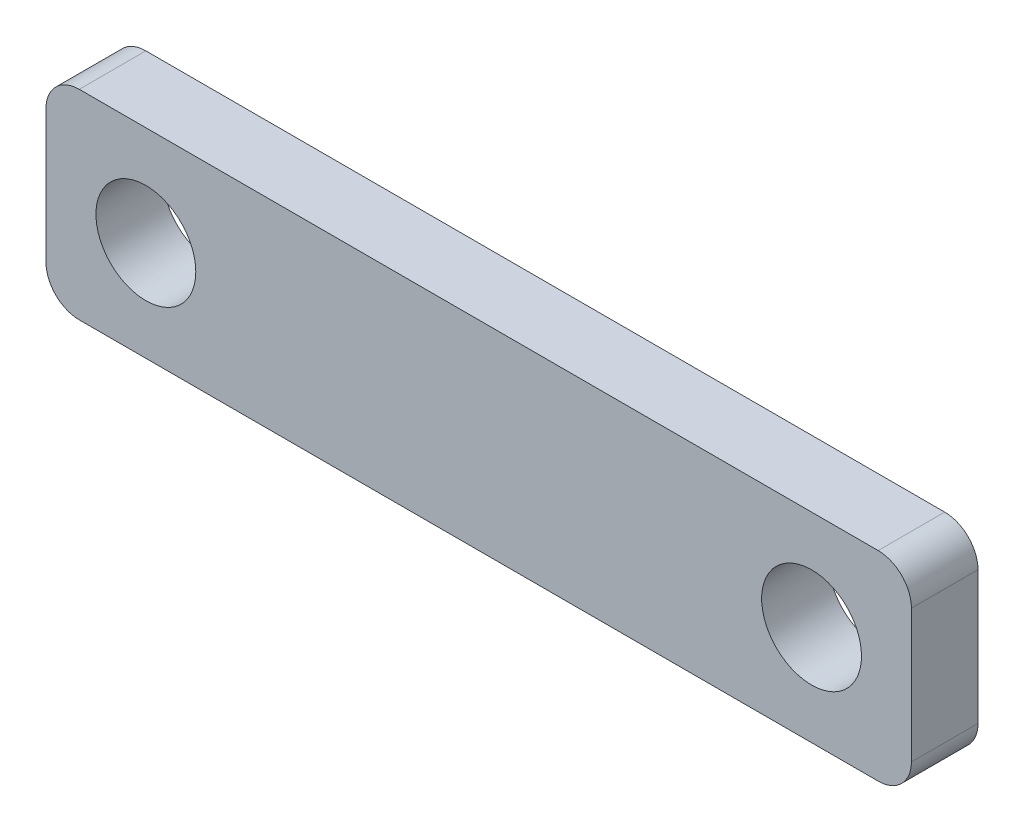
ISO-10303-21;
HEADER;
FILE_DESCRIPTION(('STEP AP214'),'2;1');
FILE_NAME('part.step','',(''),(''),'','','');
FILE_SCHEMA(('AUTOMOTIVE_DESIGN { 1 0 10303 214 1 1 1 1 }'));
ENDSEC;
DATA;
#1=APPLICATION_CONTEXT('core data for automotive mechanical design processes');
#2=APPLICATION_PROTOCOL_DEFINITION('international standard','automotive_design',2000,#1);
#3=PRODUCT_CONTEXT('',#1,'mechanical');
#4=PRODUCT('Part','Part','',(#3));
#5=PRODUCT_RELATED_PRODUCT_CATEGORY('part','',(#4));
#6=PRODUCT_DEFINITION_FORMATION('','',#4);
#7=PRODUCT_DEFINITION_CONTEXT('part definition',#1,'design');
#8=PRODUCT_DEFINITION('design','',#6,#7);
#9=PRODUCT_DEFINITION_SHAPE('','',#8);
#10=(LENGTH_UNIT() NAMED_UNIT(*) SI_UNIT(.MILLI.,.METRE.));
#11=(NAMED_UNIT(*) PLANE_ANGLE_UNIT() SI_UNIT($,.RADIAN.));
#12=(NAMED_UNIT(*) SI_UNIT($,.STERADIAN.) SOLID_ANGLE_UNIT());
#13=UNCERTAINTY_MEASURE_WITH_UNIT(LENGTH_MEASURE(1.E-05),#10,'distance_accuracy_value','');
#14=(GEOMETRIC_REPRESENTATION_CONTEXT(3) GLOBAL_UNCERTAINTY_ASSIGNED_CONTEXT((#13)) GLOBAL_UNIT_ASSIGNED_CONTEXT((#10,
#11,#12)) REPRESENTATION_CONTEXT('',''));
#15=CARTESIAN_POINT('',(0.,0.,0.));
#16=DIRECTION('',(0.,0.,1.));
#17=DIRECTION('',(1.,0.,0.));
#18=AXIS2_PLACEMENT_3D('',#15,#16,#17);
#19=CARTESIAN_POINT('',(0.,0.,2.));
#20=DIRECTION('',(0.,0.,-1.));
#21=DIRECTION('',(-1.,0.,0.));
#22=AXIS2_PLACEMENT_3D('',#19,#20,#21);
#23=PLANE('',#22);
#24=DIRECTION('',(0.,-1.,0.));
#25=VECTOR('',#24,1.);
#26=CARTESIAN_POINT('',(-13.,-3.,2.));
#27=LINE('',#26,#25);
#28=CARTESIAN_POINT('',(-13.,2.,2.));
#29=VERTEX_POINT('',#28);
#30=CARTESIAN_POINT('',(-13.,-2.,2.));
#31=VERTEX_POINT('',#30);
#32=EDGE_CURVE('E175',#29,#31,#27,.T.);
#33=ORIENTED_EDGE('',*,*,#32,.T.);
#34=CARTESIAN_POINT('',(-12.,-2.,2.));
#35=DIRECTION('',(0.,0.,-1.));
#36=DIRECTION('',(-1.,0.,0.));
#37=AXIS2_PLACEMENT_3D('',#34,#35,#36);
#38=CIRCLE('',#37,1.);
#39=CARTESIAN_POINT('',(-12.,-3.,2.));
#40=VERTEX_POINT('',#39);
#41=EDGE_CURVE('E152',#31,#40,#38,.F.);
#42=ORIENTED_EDGE('',*,*,#41,.T.);
#43=DIRECTION('',(1.,0.,0.));
#44=VECTOR('',#43,1.);
#45=CARTESIAN_POINT('',(-13.,-3.,2.));
#46=LINE('',#45,#44);
#47=CARTESIAN_POINT('',(12.,-3.,2.));
#48=VERTEX_POINT('',#47);
#49=EDGE_CURVE('E123',#40,#48,#46,.T.);
#50=ORIENTED_EDGE('',*,*,#49,.T.);
#51=CARTESIAN_POINT('',(12.,-2.,2.));
#52=DIRECTION('',(0.,0.,-1.));
#53=DIRECTION('',(-1.,0.,0.));
#54=AXIS2_PLACEMENT_3D('',#51,#52,#53);
#55=CIRCLE('',#54,1.);
#56=CARTESIAN_POINT('',(13.,-2.,2.));
#57=VERTEX_POINT('',#56);
#58=EDGE_CURVE('E150',#48,#57,#55,.F.);
#59=ORIENTED_EDGE('',*,*,#58,.T.);
#60=DIRECTION('',(0.,1.,0.));
#61=VECTOR('',#60,1.);
#62=CARTESIAN_POINT('',(13.,-3.,2.));
#63=LINE('',#62,#61);
#64=CARTESIAN_POINT('',(13.,2.,2.));
#65=VERTEX_POINT('',#64);
#66=EDGE_CURVE('E130',#57,#65,#63,.T.);
#67=ORIENTED_EDGE('',*,*,#66,.T.);
#68=CARTESIAN_POINT('',(12.,2.,2.));
#69=DIRECTION('',(0.,0.,-1.));
#70=DIRECTION('',(-1.,0.,0.));
#71=AXIS2_PLACEMENT_3D('',#68,#69,#70);
#72=CIRCLE('',#71,1.);
#73=CARTESIAN_POINT('',(12.,3.,2.));
#74=VERTEX_POINT('',#73);
#75=EDGE_CURVE('E58',#65,#74,#72,.F.);
#76=ORIENTED_EDGE('',*,*,#75,.T.);
#77=DIRECTION('',(-1.,0.,0.));
#78=VECTOR('',#77,1.);
#79=CARTESIAN_POINT('',(-13.,3.,2.));
#80=LINE('',#79,#78);
#81=CARTESIAN_POINT('',(-12.,3.,2.));
#82=VERTEX_POINT('',#81);
#83=EDGE_CURVE('E133',#74,#82,#80,.T.);
#84=ORIENTED_EDGE('',*,*,#83,.T.);
#85=CARTESIAN_POINT('',(-12.,2.,2.));
#86=DIRECTION('',(0.,0.,-1.));
#87=DIRECTION('',(-1.,0.,0.));
#88=AXIS2_PLACEMENT_3D('',#85,#86,#87);
#89=CIRCLE('',#88,1.);
#90=EDGE_CURVE('E147',#82,#29,#89,.F.);
#91=ORIENTED_EDGE('',*,*,#90,.T.);
#92=EDGE_LOOP('',(#33,#42,#50,#59,#67,#76,#84,#91));
#93=FACE_BOUND('',#92,.T.);
#94=CARTESIAN_POINT('',(10.,0.,2.));
#95=DIRECTION('',(0.,0.,1.));
#96=DIRECTION('',(1.,0.,0.));
#97=AXIS2_PLACEMENT_3D('',#94,#95,#96);
#98=CIRCLE('',#97,1.5);
#99=CARTESIAN_POINT('',(11.5,0.,2.));
#100=VERTEX_POINT('',#99);
#101=EDGE_CURVE('E168',#100,#100,#98,.T.);
#102=ORIENTED_EDGE('',*,*,#101,.F.);
#103=EDGE_LOOP('',(#102));
#104=FACE_BOUND('',#103,.T.);
#105=CARTESIAN_POINT('',(-10.,0.,2.));
#106=DIRECTION('',(0.,0.,1.));
#107=DIRECTION('',(1.,0.,0.));
#108=AXIS2_PLACEMENT_3D('',#105,#106,#107);
#109=CIRCLE('',#108,1.5);
#110=CARTESIAN_POINT('',(-8.5,0.,2.));
#111=VERTEX_POINT('',#110);
#112=EDGE_CURVE('E180',#111,#111,#109,.T.);
#113=ORIENTED_EDGE('',*,*,#112,.F.);
#114=EDGE_LOOP('',(#113));
#115=FACE_BOUND('',#114,.T.);
#116=ADVANCED_FACE('F37',(#93,#104,#115),#23,.F.);
#117=CARTESIAN_POINT('',(0.,0.,0.));
#118=DIRECTION('',(0.,0.,-1.));
#119=DIRECTION('',(-1.,0.,0.));
#120=AXIS2_PLACEMENT_3D('',#117,#118,#119);
#121=PLANE('',#120);
#122=CARTESIAN_POINT('',(10.,0.,0.));
#123=DIRECTION('',(0.,0.,1.));
#124=DIRECTION('',(1.,0.,0.));
#125=AXIS2_PLACEMENT_3D('',#122,#123,#124);
#126=CIRCLE('',#125,1.5);
#127=CARTESIAN_POINT('',(11.5,0.,0.));
#128=VERTEX_POINT('',#127);
#129=EDGE_CURVE('E171',#128,#128,#126,.T.);
#130=ORIENTED_EDGE('',*,*,#129,.T.);
#131=EDGE_LOOP('',(#130));
#132=FACE_BOUND('',#131,.T.);
#133=DIRECTION('',(1.,0.,0.));
#134=VECTOR('',#133,1.);
#135=CARTESIAN_POINT('',(-13.,-3.,0.));
#136=LINE('',#135,#134);
#137=CARTESIAN_POINT('',(-12.,-3.,0.));
#138=VERTEX_POINT('',#137);
#139=CARTESIAN_POINT('',(12.,-3.,0.));
#140=VERTEX_POINT('',#139);
#141=EDGE_CURVE('E120',#138,#140,#136,.T.);
#142=ORIENTED_EDGE('',*,*,#141,.F.);
#143=CARTESIAN_POINT('',(-12.,-2.,0.));
#144=DIRECTION('',(0.,0.,-1.));
#145=DIRECTION('',(-1.,0.,0.));
#146=AXIS2_PLACEMENT_3D('',#143,#144,#145);
#147=CIRCLE('',#146,1.);
#148=CARTESIAN_POINT('',(-13.,-2.,0.));
#149=VERTEX_POINT('',#148);
#150=EDGE_CURVE('E103',#138,#149,#147,.T.);
#151=ORIENTED_EDGE('',*,*,#150,.T.);
#152=DIRECTION('',(0.,-1.,0.));
#153=VECTOR('',#152,1.);
#154=CARTESIAN_POINT('',(-13.,-3.,0.));
#155=LINE('',#154,#153);
#156=CARTESIAN_POINT('',(-13.,2.,0.));
#157=VERTEX_POINT('',#156);
#158=EDGE_CURVE('E131',#157,#149,#155,.T.);
#159=ORIENTED_EDGE('',*,*,#158,.F.);
#160=CARTESIAN_POINT('',(-12.,2.,0.));
#161=DIRECTION('',(0.,0.,-1.));
#162=DIRECTION('',(-1.,0.,0.));
#163=AXIS2_PLACEMENT_3D('',#160,#161,#162);
#164=CIRCLE('',#163,1.);
#165=CARTESIAN_POINT('',(-12.,3.,0.));
#166=VERTEX_POINT('',#165);
#167=EDGE_CURVE('E124',#157,#166,#164,.T.);
#168=ORIENTED_EDGE('',*,*,#167,.T.);
#169=DIRECTION('',(-1.,0.,0.));
#170=VECTOR('',#169,1.);
#171=CARTESIAN_POINT('',(-13.,3.,0.));
#172=LINE('',#171,#170);
#173=CARTESIAN_POINT('',(12.,3.,0.));
#174=VERTEX_POINT('',#173);
#175=EDGE_CURVE('E135',#174,#166,#172,.T.);
#176=ORIENTED_EDGE('',*,*,#175,.F.);
#177=CARTESIAN_POINT('',(12.,2.,0.));
#178=DIRECTION('',(0.,0.,-1.));
#179=DIRECTION('',(-1.,0.,0.));
#180=AXIS2_PLACEMENT_3D('',#177,#178,#179);
#181=CIRCLE('',#180,1.);
#182=CARTESIAN_POINT('',(13.,2.,0.));
#183=VERTEX_POINT('',#182);
#184=EDGE_CURVE('E141',#174,#183,#181,.T.);
#185=ORIENTED_EDGE('',*,*,#184,.T.);
#186=DIRECTION('',(0.,1.,0.));
#187=VECTOR('',#186,1.);
#188=CARTESIAN_POINT('',(13.,-3.,0.));
#189=LINE('',#188,#187);
#190=CARTESIAN_POINT('',(13.,-2.,0.));
#191=VERTEX_POINT('',#190);
#192=EDGE_CURVE('E163',#191,#183,#189,.T.);
#193=ORIENTED_EDGE('',*,*,#192,.F.);
#194=CARTESIAN_POINT('',(12.,-2.,0.));
#195=DIRECTION('',(0.,0.,-1.));
#196=DIRECTION('',(-1.,0.,0.));
#197=AXIS2_PLACEMENT_3D('',#194,#195,#196);
#198=CIRCLE('',#197,1.);
#199=EDGE_CURVE('E114',#191,#140,#198,.T.);
#200=ORIENTED_EDGE('',*,*,#199,.T.);
#201=EDGE_LOOP('',(#142,#151,#159,#168,#176,#185,#193,#200));
#202=FACE_BOUND('',#201,.T.);
#203=CARTESIAN_POINT('',(-10.,0.,0.));
#204=DIRECTION('',(0.,0.,1.));
#205=DIRECTION('',(1.,0.,0.));
#206=AXIS2_PLACEMENT_3D('',#203,#204,#205);
#207=CIRCLE('',#206,1.5);
#208=CARTESIAN_POINT('',(-8.5,0.,0.));
#209=VERTEX_POINT('',#208);
#210=EDGE_CURVE('E182',#209,#209,#207,.T.);
#211=ORIENTED_EDGE('',*,*,#210,.T.);
#212=EDGE_LOOP('',(#211));
#213=FACE_BOUND('',#212,.T.);
#214=ADVANCED_FACE('F127',(#132,#202,#213),#121,.T.);
#215=CARTESIAN_POINT('',(13.,-3.,2.));
#216=DIRECTION('',(-1.,0.,0.));
#217=DIRECTION('',(0.,0.,1.));
#218=AXIS2_PLACEMENT_3D('',#215,#216,#217);
#219=PLANE('',#218);
#220=ORIENTED_EDGE('',*,*,#66,.F.);
#221=DIRECTION('',(0.,0.,-1.));
#222=VECTOR('',#221,1.);
#223=CARTESIAN_POINT('',(13.,-2.,2.));
#224=LINE('',#223,#222);
#225=EDGE_CURVE('E156',#57,#191,#224,.T.);
#226=ORIENTED_EDGE('',*,*,#225,.T.);
#227=ORIENTED_EDGE('',*,*,#192,.T.);
#228=DIRECTION('',(0.,0.,-1.));
#229=VECTOR('',#228,1.);
#230=CARTESIAN_POINT('',(13.,2.,2.));
#231=LINE('',#230,#229);
#232=EDGE_CURVE('E154',#183,#65,#231,.F.);
#233=ORIENTED_EDGE('',*,*,#232,.T.);
#234=EDGE_LOOP('',(#220,#226,#227,#233));
#235=FACE_BOUND('',#234,.T.);
#236=ADVANCED_FACE('F162',(#235),#219,.F.);
#237=CARTESIAN_POINT('',(-13.,3.,2.));
#238=DIRECTION('',(0.,-1.,0.));
#239=DIRECTION('',(0.,0.,-1.));
#240=AXIS2_PLACEMENT_3D('',#237,#238,#239);
#241=PLANE('',#240);
#242=ORIENTED_EDGE('',*,*,#83,.F.);
#243=DIRECTION('',(0.,0.,-1.));
#244=VECTOR('',#243,1.);
#245=CARTESIAN_POINT('',(12.,3.,2.));
#246=LINE('',#245,#244);
#247=EDGE_CURVE('E11',#74,#174,#246,.T.);
#248=ORIENTED_EDGE('',*,*,#247,.T.);
#249=ORIENTED_EDGE('',*,*,#175,.T.);
#250=DIRECTION('',(0.,0.,-1.));
#251=VECTOR('',#250,1.);
#252=CARTESIAN_POINT('',(-12.,3.,2.));
#253=LINE('',#252,#251);
#254=EDGE_CURVE('E45',#166,#82,#253,.F.);
#255=ORIENTED_EDGE('',*,*,#254,.T.);
#256=EDGE_LOOP('',(#242,#248,#249,#255));
#257=FACE_BOUND('',#256,.T.);
#258=ADVANCED_FACE('F208',(#257),#241,.F.);
#259=CARTESIAN_POINT('',(-13.,-3.,2.));
#260=DIRECTION('',(1.,0.,0.));
#261=DIRECTION('',(0.,0.,-1.));
#262=AXIS2_PLACEMENT_3D('',#259,#260,#261);
#263=PLANE('',#262);
#264=ORIENTED_EDGE('',*,*,#158,.T.);
#265=DIRECTION('',(0.,0.,-1.));
#266=VECTOR('',#265,1.);
#267=CARTESIAN_POINT('',(-13.,-2.,2.));
#268=LINE('',#267,#266);
#269=EDGE_CURVE('E108',#149,#31,#268,.F.);
#270=ORIENTED_EDGE('',*,*,#269,.T.);
#271=ORIENTED_EDGE('',*,*,#32,.F.);
#272=DIRECTION('',(0.,0.,-1.));
#273=VECTOR('',#272,1.);
#274=CARTESIAN_POINT('',(-13.,2.,2.));
#275=LINE('',#274,#273);
#276=EDGE_CURVE('E113',#29,#157,#275,.T.);
#277=ORIENTED_EDGE('',*,*,#276,.T.);
#278=EDGE_LOOP('',(#264,#270,#271,#277));
#279=FACE_BOUND('',#278,.T.);
#280=ADVANCED_FACE('F205',(#279),#263,.F.);
#281=CARTESIAN_POINT('',(-13.,-3.,2.));
#282=DIRECTION('',(0.,1.,0.));
#283=DIRECTION('',(0.,0.,1.));
#284=AXIS2_PLACEMENT_3D('',#281,#282,#283);
#285=PLANE('',#284);
#286=ORIENTED_EDGE('',*,*,#49,.F.);
#287=DIRECTION('',(0.,0.,-1.));
#288=VECTOR('',#287,1.);
#289=CARTESIAN_POINT('',(-12.,-3.,2.));
#290=LINE('',#289,#288);
#291=EDGE_CURVE('E107',#40,#138,#290,.T.);
#292=ORIENTED_EDGE('',*,*,#291,.T.);
#293=ORIENTED_EDGE('',*,*,#141,.T.);
#294=DIRECTION('',(0.,0.,-1.));
#295=VECTOR('',#294,1.);
#296=CARTESIAN_POINT('',(12.,-3.,2.));
#297=LINE('',#296,#295);
#298=EDGE_CURVE('E125',#140,#48,#297,.F.);
#299=ORIENTED_EDGE('',*,*,#298,.T.);
#300=EDGE_LOOP('',(#286,#292,#293,#299));
#301=FACE_BOUND('',#300,.T.);
#302=ADVANCED_FACE('F119',(#301),#285,.F.);
#303=CARTESIAN_POINT('',(10.,0.,2.));
#304=DIRECTION('',(0.,0.,-1.));
#305=DIRECTION('',(-1.,0.,0.));
#306=AXIS2_PLACEMENT_3D('',#303,#304,#305);
#307=CYLINDRICAL_SURFACE('',#306,1.5);
#308=ORIENTED_EDGE('',*,*,#101,.T.);
#309=EDGE_LOOP('',(#308));
#310=FACE_BOUND('',#309,.T.);
#311=ORIENTED_EDGE('',*,*,#129,.F.);
#312=EDGE_LOOP('',(#311));
#313=FACE_BOUND('',#312,.T.);
#314=ADVANCED_FACE('F200',(#310,#313),#307,.F.);
#315=CARTESIAN_POINT('',(-10.,0.,2.));
#316=DIRECTION('',(0.,0.,-1.));
#317=DIRECTION('',(-1.,0.,0.));
#318=AXIS2_PLACEMENT_3D('',#315,#316,#317);
#319=CYLINDRICAL_SURFACE('',#318,1.5);
#320=ORIENTED_EDGE('',*,*,#112,.T.);
#321=EDGE_LOOP('',(#320));
#322=FACE_BOUND('',#321,.T.);
#323=ORIENTED_EDGE('',*,*,#210,.F.);
#324=EDGE_LOOP('',(#323));
#325=FACE_BOUND('',#324,.T.);
#326=ADVANCED_FACE('F188',(#322,#325),#319,.F.);
#327=CARTESIAN_POINT('',(-12.,-2.,2.));
#328=DIRECTION('',(0.,0.,-1.));
#329=DIRECTION('',(-1.,0.,0.));
#330=AXIS2_PLACEMENT_3D('',#327,#328,#329);
#331=CYLINDRICAL_SURFACE('',#330,1.);
#332=ORIENTED_EDGE('',*,*,#41,.F.);
#333=ORIENTED_EDGE('',*,*,#269,.F.);
#334=ORIENTED_EDGE('',*,*,#150,.F.);
#335=ORIENTED_EDGE('',*,*,#291,.F.);
#336=EDGE_LOOP('',(#332,#333,#334,#335));
#337=FACE_BOUND('',#336,.T.);
#338=ADVANCED_FACE('F106',(#337),#331,.T.);
#339=CARTESIAN_POINT('',(12.,-2.,2.));
#340=DIRECTION('',(0.,0.,-1.));
#341=DIRECTION('',(-1.,0.,0.));
#342=AXIS2_PLACEMENT_3D('',#339,#340,#341);
#343=CYLINDRICAL_SURFACE('',#342,1.);
#344=ORIENTED_EDGE('',*,*,#58,.F.);
#345=ORIENTED_EDGE('',*,*,#298,.F.);
#346=ORIENTED_EDGE('',*,*,#199,.F.);
#347=ORIENTED_EDGE('',*,*,#225,.F.);
#348=EDGE_LOOP('',(#344,#345,#346,#347));
#349=FACE_BOUND('',#348,.T.);
#350=ADVANCED_FACE('F216',(#349),#343,.T.);
#351=CARTESIAN_POINT('',(12.,2.,2.));
#352=DIRECTION('',(0.,0.,-1.));
#353=DIRECTION('',(-1.,0.,0.));
#354=AXIS2_PLACEMENT_3D('',#351,#352,#353);
#355=CYLINDRICAL_SURFACE('',#354,1.);
#356=ORIENTED_EDGE('',*,*,#75,.F.);
#357=ORIENTED_EDGE('',*,*,#232,.F.);
#358=ORIENTED_EDGE('',*,*,#184,.F.);
#359=ORIENTED_EDGE('',*,*,#247,.F.);
#360=EDGE_LOOP('',(#356,#357,#358,#359));
#361=FACE_BOUND('',#360,.T.);
#362=ADVANCED_FACE('F218',(#361),#355,.T.);
#363=CARTESIAN_POINT('',(-12.,2.,2.));
#364=DIRECTION('',(0.,0.,-1.));
#365=DIRECTION('',(-1.,0.,0.));
#366=AXIS2_PLACEMENT_3D('',#363,#364,#365);
#367=CYLINDRICAL_SURFACE('',#366,1.);
#368=ORIENTED_EDGE('',*,*,#90,.F.);
#369=ORIENTED_EDGE('',*,*,#254,.F.);
#370=ORIENTED_EDGE('',*,*,#167,.F.);
#371=ORIENTED_EDGE('',*,*,#276,.F.);
#372=EDGE_LOOP('',(#368,#369,#370,#371));
#373=FACE_BOUND('',#372,.T.);
#374=ADVANCED_FACE('F39',(#373),#367,.T.);
#375=CLOSED_SHELL('',(#116,#214,#236,#258,#280,#302,#314,#326,#338,#350,#362,#374));
#376=MANIFOLD_SOLID_BREP('B2',#375);
#377=ADVANCED_BREP_SHAPE_REPRESENTATION('',(#18,#376),#14);
#378=SHAPE_DEFINITION_REPRESENTATION(#9,#377);
ENDSEC;
END-ISO-10303-21;
